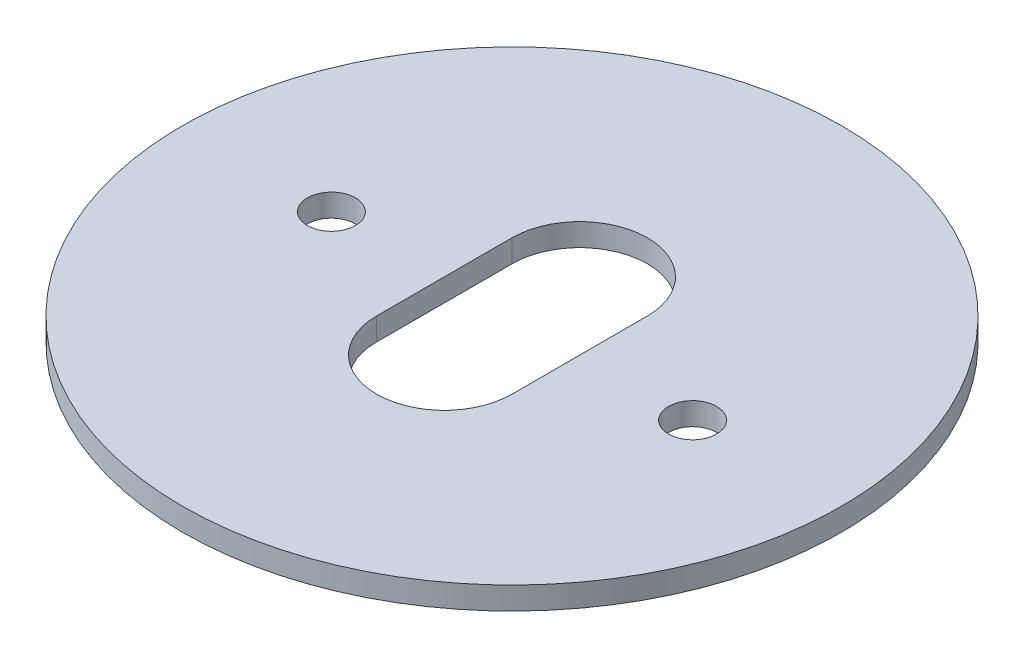
ISO-10303-21;
HEADER;
FILE_DESCRIPTION(('STEP AP214'),'2;1');
FILE_NAME('part.step','',(''),(''),'','','');
FILE_SCHEMA(('AUTOMOTIVE_DESIGN { 1 0 10303 214 1 1 1 1 }'));
ENDSEC;
DATA;
#1=APPLICATION_CONTEXT('core data for automotive mechanical design processes');
#2=APPLICATION_PROTOCOL_DEFINITION('international standard','automotive_design',2000,#1);
#3=PRODUCT_CONTEXT('',#1,'mechanical');
#4=PRODUCT('Part','Part','',(#3));
#5=PRODUCT_RELATED_PRODUCT_CATEGORY('part','',(#4));
#6=PRODUCT_DEFINITION_FORMATION('','',#4);
#7=PRODUCT_DEFINITION_CONTEXT('part definition',#1,'design');
#8=PRODUCT_DEFINITION('design','',#6,#7);
#9=PRODUCT_DEFINITION_SHAPE('','',#8);
#10=(LENGTH_UNIT() NAMED_UNIT(*) SI_UNIT(.MILLI.,.METRE.));
#11=(NAMED_UNIT(*) PLANE_ANGLE_UNIT() SI_UNIT($,.RADIAN.));
#12=(NAMED_UNIT(*) SI_UNIT($,.STERADIAN.) SOLID_ANGLE_UNIT());
#13=UNCERTAINTY_MEASURE_WITH_UNIT(LENGTH_MEASURE(1.E-05),#10,'distance_accuracy_value','');
#14=(GEOMETRIC_REPRESENTATION_CONTEXT(3) GLOBAL_UNCERTAINTY_ASSIGNED_CONTEXT((#13)) GLOBAL_UNIT_ASSIGNED_CONTEXT((#10,
#11,#12)) REPRESENTATION_CONTEXT('',''));
#15=CARTESIAN_POINT('',(0.,0.,0.));
#16=DIRECTION('',(0.,0.,1.));
#17=DIRECTION('',(1.,0.,0.));
#18=AXIS2_PLACEMENT_3D('',#15,#16,#17);
#19=CARTESIAN_POINT('',(0.,1.5875,0.));
#20=DIRECTION('',(0.,-1.,0.));
#21=DIRECTION('',(0.,0.,-1.));
#22=AXIS2_PLACEMENT_3D('',#19,#20,#21);
#23=CYLINDRICAL_SURFACE('',#22,46.355);
#24=CARTESIAN_POINT('',(0.,1.5875,0.));
#25=DIRECTION('',(0.,1.,0.));
#26=DIRECTION('',(0.,0.,1.));
#27=AXIS2_PLACEMENT_3D('',#24,#25,#26);
#28=CIRCLE('',#27,46.355);
#29=CARTESIAN_POINT('',(0.,1.5875,46.355));
#30=VERTEX_POINT('',#29);
#31=EDGE_CURVE('E11',#30,#30,#28,.T.);
#32=ORIENTED_EDGE('',*,*,#31,.F.);
#33=EDGE_LOOP('',(#32));
#34=FACE_BOUND('',#33,.T.);
#35=CARTESIAN_POINT('',(0.,-1.5875,0.));
#36=DIRECTION('',(0.,1.,0.));
#37=DIRECTION('',(0.,0.,1.));
#38=AXIS2_PLACEMENT_3D('',#35,#36,#37);
#39=CIRCLE('',#38,46.355);
#40=CARTESIAN_POINT('',(0.,-1.5875,46.355));
#41=VERTEX_POINT('',#40);
#42=EDGE_CURVE('E47',#41,#41,#39,.T.);
#43=ORIENTED_EDGE('',*,*,#42,.T.);
#44=EDGE_LOOP('',(#43));
#45=FACE_BOUND('',#44,.T.);
#46=ADVANCED_FACE('F39',(#34,#45),#23,.T.);
#47=CARTESIAN_POINT('',(0.,1.5875,0.));
#48=DIRECTION('',(0.,1.,0.));
#49=DIRECTION('',(0.,0.,1.));
#50=AXIS2_PLACEMENT_3D('',#47,#48,#49);
#51=PLANE('',#50);
#52=CARTESIAN_POINT('',(0.,1.5875,-9.525));
#53=DIRECTION('',(0.,1.,0.));
#54=DIRECTION('',(0.,0.,1.));
#55=AXIS2_PLACEMENT_3D('',#52,#53,#54);
#56=CIRCLE('',#55,9.525);
#57=CARTESIAN_POINT('',(9.525,1.5875,-9.525));
#58=VERTEX_POINT('',#57);
#59=CARTESIAN_POINT('',(-9.525,1.5875,-9.525));
#60=VERTEX_POINT('',#59);
#61=EDGE_CURVE('E55',#58,#60,#56,.T.);
#62=ORIENTED_EDGE('',*,*,#61,.F.);
#63=DIRECTION('',(0.,0.,-1.));
#64=VECTOR('',#63,1.);
#65=CARTESIAN_POINT('',(9.525,1.5875,-9.525));
#66=LINE('',#65,#64);
#67=CARTESIAN_POINT('',(9.525,1.5875,9.525));
#68=VERTEX_POINT('',#67);
#69=EDGE_CURVE('E99',#68,#58,#66,.T.);
#70=ORIENTED_EDGE('',*,*,#69,.F.);
#71=CARTESIAN_POINT('',(0.,1.5875,9.525));
#72=DIRECTION('',(0.,1.,0.));
#73=DIRECTION('',(0.,0.,1.));
#74=AXIS2_PLACEMENT_3D('',#71,#72,#73);
#75=CIRCLE('',#74,9.525);
#76=CARTESIAN_POINT('',(-9.525,1.5875,9.525));
#77=VERTEX_POINT('',#76);
#78=EDGE_CURVE('E102',#77,#68,#75,.T.);
#79=ORIENTED_EDGE('',*,*,#78,.F.);
#80=DIRECTION('',(0.,0.,1.));
#81=VECTOR('',#80,1.);
#82=CARTESIAN_POINT('',(-9.525,1.5875,-9.525));
#83=LINE('',#82,#81);
#84=EDGE_CURVE('E108',#60,#77,#83,.T.);
#85=ORIENTED_EDGE('',*,*,#84,.F.);
#86=EDGE_LOOP('',(#62,#70,#79,#85));
#87=FACE_BOUND('',#86,.T.);
#88=CARTESIAN_POINT('',(-25.4,1.5875,0.));
#89=DIRECTION('',(0.,1.,0.));
#90=DIRECTION('',(0.,0.,1.));
#91=AXIS2_PLACEMENT_3D('',#88,#89,#90);
#92=CIRCLE('',#91,3.37819999999999);
#93=CARTESIAN_POINT('',(-25.4,1.5875,3.37819999999999));
#94=VERTEX_POINT('',#93);
#95=EDGE_CURVE('E114',#94,#94,#92,.T.);
#96=ORIENTED_EDGE('',*,*,#95,.F.);
#97=EDGE_LOOP('',(#96));
#98=FACE_BOUND('',#97,.T.);
#99=CARTESIAN_POINT('',(25.4,1.5875,0.));
#100=DIRECTION('',(0.,1.,0.));
#101=DIRECTION('',(0.,0.,1.));
#102=AXIS2_PLACEMENT_3D('',#99,#100,#101);
#103=CIRCLE('',#102,3.37819999999999);
#104=CARTESIAN_POINT('',(25.4,1.5875,3.37819999999998));
#105=VERTEX_POINT('',#104);
#106=EDGE_CURVE('E120',#105,#105,#103,.T.);
#107=ORIENTED_EDGE('',*,*,#106,.F.);
#108=EDGE_LOOP('',(#107));
#109=FACE_BOUND('',#108,.T.);
#110=ORIENTED_EDGE('',*,*,#31,.T.);
#111=EDGE_LOOP('',(#110));
#112=FACE_BOUND('',#111,.T.);
#113=ADVANCED_FACE('F131',(#87,#98,#109,#112),#51,.T.);
#114=CARTESIAN_POINT('',(0.,-1.5875,0.));
#115=DIRECTION('',(0.,1.,0.));
#116=DIRECTION('',(0.,0.,1.));
#117=AXIS2_PLACEMENT_3D('',#114,#115,#116);
#118=PLANE('',#117);
#119=DIRECTION('',(0.,0.,-1.));
#120=VECTOR('',#119,1.);
#121=CARTESIAN_POINT('',(9.525,-1.5875,-9.525));
#122=LINE('',#121,#120);
#123=CARTESIAN_POINT('',(9.525,-1.5875,9.525));
#124=VERTEX_POINT('',#123);
#125=CARTESIAN_POINT('',(9.525,-1.5875,-9.525));
#126=VERTEX_POINT('',#125);
#127=EDGE_CURVE('E89',#124,#126,#122,.T.);
#128=ORIENTED_EDGE('',*,*,#127,.T.);
#129=CARTESIAN_POINT('',(0.,-1.5875,-9.525));
#130=DIRECTION('',(0.,1.,0.));
#131=DIRECTION('',(0.,0.,1.));
#132=AXIS2_PLACEMENT_3D('',#129,#130,#131);
#133=CIRCLE('',#132,9.525);
#134=CARTESIAN_POINT('',(-9.525,-1.5875,-9.525));
#135=VERTEX_POINT('',#134);
#136=EDGE_CURVE('E83',#126,#135,#133,.T.);
#137=ORIENTED_EDGE('',*,*,#136,.T.);
#138=DIRECTION('',(0.,0.,1.));
#139=VECTOR('',#138,1.);
#140=CARTESIAN_POINT('',(-9.525,-1.5875,-9.525));
#141=LINE('',#140,#139);
#142=CARTESIAN_POINT('',(-9.525,-1.5875,9.525));
#143=VERTEX_POINT('',#142);
#144=EDGE_CURVE('E92',#135,#143,#141,.T.);
#145=ORIENTED_EDGE('',*,*,#144,.T.);
#146=CARTESIAN_POINT('',(0.,-1.5875,9.525));
#147=DIRECTION('',(0.,1.,0.));
#148=DIRECTION('',(0.,0.,1.));
#149=AXIS2_PLACEMENT_3D('',#146,#147,#148);
#150=CIRCLE('',#149,9.525);
#151=EDGE_CURVE('E63',#143,#124,#150,.T.);
#152=ORIENTED_EDGE('',*,*,#151,.T.);
#153=EDGE_LOOP('',(#128,#137,#145,#152));
#154=FACE_BOUND('',#153,.T.);
#155=CARTESIAN_POINT('',(-25.4,-1.5875,0.));
#156=DIRECTION('',(0.,1.,0.));
#157=DIRECTION('',(0.,0.,1.));
#158=AXIS2_PLACEMENT_3D('',#155,#156,#157);
#159=CIRCLE('',#158,3.37819999999999);
#160=CARTESIAN_POINT('',(-25.4,-1.5875,3.37819999999999));
#161=VERTEX_POINT('',#160);
#162=EDGE_CURVE('E42',#161,#161,#159,.T.);
#163=ORIENTED_EDGE('',*,*,#162,.T.);
#164=EDGE_LOOP('',(#163));
#165=FACE_BOUND('',#164,.T.);
#166=CARTESIAN_POINT('',(25.4,-1.5875,0.));
#167=DIRECTION('',(0.,1.,0.));
#168=DIRECTION('',(0.,0.,1.));
#169=AXIS2_PLACEMENT_3D('',#166,#167,#168);
#170=CIRCLE('',#169,3.37819999999999);
#171=CARTESIAN_POINT('',(25.4,-1.5875,3.37819999999998));
#172=VERTEX_POINT('',#171);
#173=EDGE_CURVE('E123',#172,#172,#170,.T.);
#174=ORIENTED_EDGE('',*,*,#173,.T.);
#175=EDGE_LOOP('',(#174));
#176=FACE_BOUND('',#175,.T.);
#177=ORIENTED_EDGE('',*,*,#42,.F.);
#178=EDGE_LOOP('',(#177));
#179=FACE_BOUND('',#178,.T.);
#180=ADVANCED_FACE('F96',(#154,#165,#176,#179),#118,.F.);
#181=CARTESIAN_POINT('',(25.4,1.5875,0.));
#182=DIRECTION('',(0.,1.,0.));
#183=DIRECTION('',(0.,0.,1.));
#184=AXIS2_PLACEMENT_3D('',#181,#182,#183);
#185=CYLINDRICAL_SURFACE('',#184,3.37819999999999);
#186=ORIENTED_EDGE('',*,*,#106,.T.);
#187=EDGE_LOOP('',(#186));
#188=FACE_BOUND('',#187,.T.);
#189=ORIENTED_EDGE('',*,*,#173,.F.);
#190=EDGE_LOOP('',(#189));
#191=FACE_BOUND('',#190,.T.);
#192=ADVANCED_FACE('F130',(#188,#191),#185,.F.);
#193=CARTESIAN_POINT('',(-25.4,1.5875,0.));
#194=DIRECTION('',(0.,1.,0.));
#195=DIRECTION('',(0.,0.,1.));
#196=AXIS2_PLACEMENT_3D('',#193,#194,#195);
#197=CYLINDRICAL_SURFACE('',#196,3.37819999999999);
#198=ORIENTED_EDGE('',*,*,#95,.T.);
#199=EDGE_LOOP('',(#198));
#200=FACE_BOUND('',#199,.T.);
#201=ORIENTED_EDGE('',*,*,#162,.F.);
#202=EDGE_LOOP('',(#201));
#203=FACE_BOUND('',#202,.T.);
#204=ADVANCED_FACE('F137',(#200,#203),#197,.F.);
#205=CARTESIAN_POINT('',(0.,-1.5875,-9.525));
#206=DIRECTION('',(0.,1.,0.));
#207=DIRECTION('',(0.,0.,1.));
#208=AXIS2_PLACEMENT_3D('',#205,#206,#207);
#209=CYLINDRICAL_SURFACE('',#208,9.525);
#210=ORIENTED_EDGE('',*,*,#61,.T.);
#211=DIRECTION('',(0.,1.,0.));
#212=VECTOR('',#211,1.);
#213=CARTESIAN_POINT('',(-9.525,-1.5875,-9.525));
#214=LINE('',#213,#212);
#215=EDGE_CURVE('E79',#135,#60,#214,.T.);
#216=ORIENTED_EDGE('',*,*,#215,.F.);
#217=ORIENTED_EDGE('',*,*,#136,.F.);
#218=DIRECTION('',(0.,1.,0.));
#219=VECTOR('',#218,1.);
#220=CARTESIAN_POINT('',(9.525,-1.5875,-9.525));
#221=LINE('',#220,#219);
#222=EDGE_CURVE('E112',#126,#58,#221,.T.);
#223=ORIENTED_EDGE('',*,*,#222,.T.);
#224=EDGE_LOOP('',(#210,#216,#217,#223));
#225=FACE_BOUND('',#224,.T.);
#226=ADVANCED_FACE('F81',(#225),#209,.F.);
#227=CARTESIAN_POINT('',(9.525,-1.5875,-9.525));
#228=DIRECTION('',(1.,0.,0.));
#229=DIRECTION('',(0.,0.,-1.));
#230=AXIS2_PLACEMENT_3D('',#227,#228,#229);
#231=PLANE('',#230);
#232=ORIENTED_EDGE('',*,*,#69,.T.);
#233=ORIENTED_EDGE('',*,*,#222,.F.);
#234=ORIENTED_EDGE('',*,*,#127,.F.);
#235=DIRECTION('',(0.,1.,0.));
#236=VECTOR('',#235,1.);
#237=CARTESIAN_POINT('',(9.525,-1.5875,9.525));
#238=LINE('',#237,#236);
#239=EDGE_CURVE('E115',#124,#68,#238,.T.);
#240=ORIENTED_EDGE('',*,*,#239,.T.);
#241=EDGE_LOOP('',(#232,#233,#234,#240));
#242=FACE_BOUND('',#241,.T.);
#243=ADVANCED_FACE('F180',(#242),#231,.F.);
#244=CARTESIAN_POINT('',(0.,-1.5875,9.525));
#245=DIRECTION('',(0.,1.,0.));
#246=DIRECTION('',(0.,0.,1.));
#247=AXIS2_PLACEMENT_3D('',#244,#245,#246);
#248=CYLINDRICAL_SURFACE('',#247,9.525);
#249=ORIENTED_EDGE('',*,*,#78,.T.);
#250=ORIENTED_EDGE('',*,*,#239,.F.);
#251=ORIENTED_EDGE('',*,*,#151,.F.);
#252=DIRECTION('',(0.,1.,0.));
#253=VECTOR('',#252,1.);
#254=CARTESIAN_POINT('',(-9.525,-1.5875,9.525));
#255=LINE('',#254,#253);
#256=EDGE_CURVE('E88',#143,#77,#255,.T.);
#257=ORIENTED_EDGE('',*,*,#256,.T.);
#258=EDGE_LOOP('',(#249,#250,#251,#257));
#259=FACE_BOUND('',#258,.T.);
#260=ADVANCED_FACE('F188',(#259),#248,.F.);
#261=CARTESIAN_POINT('',(-9.525,-1.5875,-9.525));
#262=DIRECTION('',(-1.,0.,0.));
#263=DIRECTION('',(0.,0.,1.));
#264=AXIS2_PLACEMENT_3D('',#261,#262,#263);
#265=PLANE('',#264);
#266=ORIENTED_EDGE('',*,*,#84,.T.);
#267=ORIENTED_EDGE('',*,*,#256,.F.);
#268=ORIENTED_EDGE('',*,*,#144,.F.);
#269=ORIENTED_EDGE('',*,*,#215,.T.);
#270=EDGE_LOOP('',(#266,#267,#268,#269));
#271=FACE_BOUND('',#270,.T.);
#272=ADVANCED_FACE('F93',(#271),#265,.F.);
#273=CLOSED_SHELL('',(#46,#113,#180,#192,#204,#226,#243,#260,#272));
#274=MANIFOLD_SOLID_BREP('B2',#273);
#275=ADVANCED_BREP_SHAPE_REPRESENTATION('',(#18,#274),#14);
#276=SHAPE_DEFINITION_REPRESENTATION(#9,#275);
ENDSEC;
END-ISO-10303-21;
